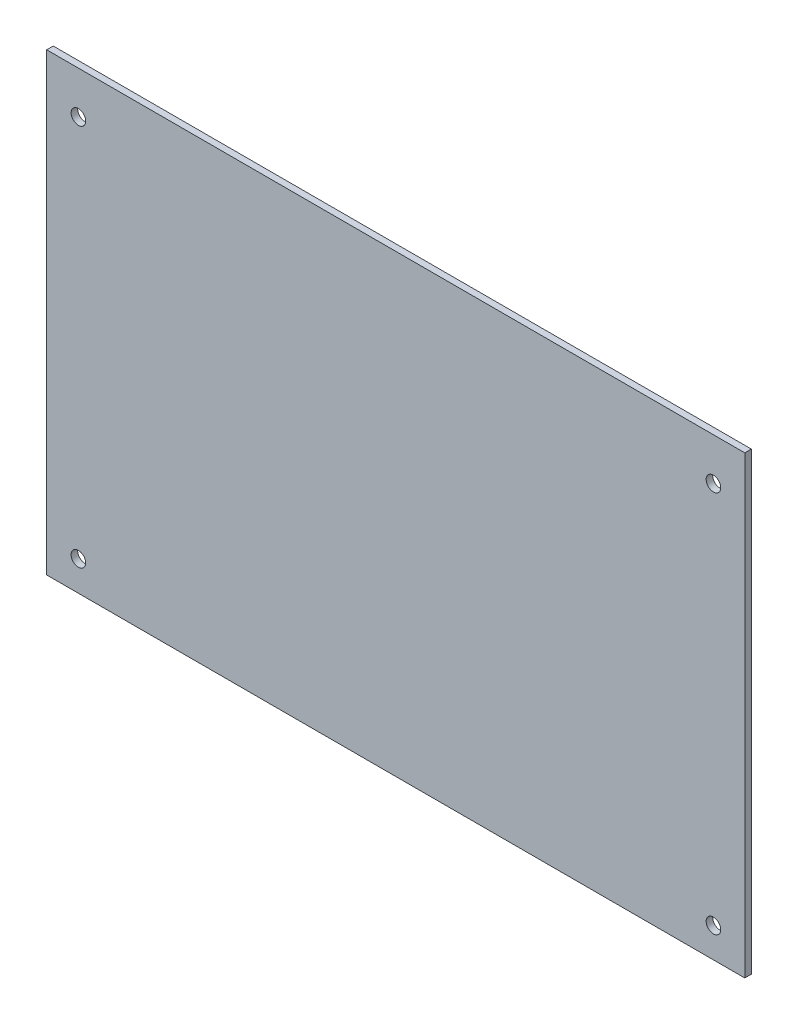
ISO-10303-21;
HEADER;
FILE_DESCRIPTION(('STEP AP214'),'2;1');
FILE_NAME('part.step','',(''),(''),'','','');
FILE_SCHEMA(('AUTOMOTIVE_DESIGN { 1 0 10303 214 1 1 1 1 }'));
ENDSEC;
DATA;
#1=APPLICATION_CONTEXT('core data for automotive mechanical design processes');
#2=APPLICATION_PROTOCOL_DEFINITION('international standard','automotive_design',2000,#1);
#3=PRODUCT_CONTEXT('',#1,'mechanical');
#4=PRODUCT('Part','Part','',(#3));
#5=PRODUCT_RELATED_PRODUCT_CATEGORY('part','',(#4));
#6=PRODUCT_DEFINITION_FORMATION('','',#4);
#7=PRODUCT_DEFINITION_CONTEXT('part definition',#1,'design');
#8=PRODUCT_DEFINITION('design','',#6,#7);
#9=PRODUCT_DEFINITION_SHAPE('','',#8);
#10=(LENGTH_UNIT() NAMED_UNIT(*) SI_UNIT(.MILLI.,.METRE.));
#11=(NAMED_UNIT(*) PLANE_ANGLE_UNIT() SI_UNIT($,.RADIAN.));
#12=(NAMED_UNIT(*) SI_UNIT($,.STERADIAN.) SOLID_ANGLE_UNIT());
#13=UNCERTAINTY_MEASURE_WITH_UNIT(LENGTH_MEASURE(1.E-05),#10,'distance_accuracy_value','');
#14=(GEOMETRIC_REPRESENTATION_CONTEXT(3) GLOBAL_UNCERTAINTY_ASSIGNED_CONTEXT((#13)) GLOBAL_UNIT_ASSIGNED_CONTEXT((#10,
#11,#12)) REPRESENTATION_CONTEXT('',''));
#15=CARTESIAN_POINT('',(0.,0.,0.));
#16=DIRECTION('',(0.,0.,1.));
#17=DIRECTION('',(1.,0.,0.));
#18=AXIS2_PLACEMENT_3D('',#15,#16,#17);
#19=CARTESIAN_POINT('',(-37.4746568246568,-37.6213286713287,0.));
#20=DIRECTION('',(0.,0.,1.));
#21=DIRECTION('',(1.,0.,0.));
#22=AXIS2_PLACEMENT_3D('',#19,#20,#21);
#23=PLANE('',#22);
#24=CARTESIAN_POINT('',(122.645343175343,-30.4613286713287,0.));
#25=DIRECTION('',(0.,0.,1.));
#26=DIRECTION('',(1.,0.,0.));
#27=AXIS2_PLACEMENT_3D('',#24,#25,#26);
#28=CIRCLE('',#27,1.75);
#29=CARTESIAN_POINT('',(124.395343175343,-30.4613286713287,0.));
#30=VERTEX_POINT('',#29);
#31=EDGE_CURVE('E39',#30,#30,#28,.T.);
#32=ORIENTED_EDGE('',*,*,#31,.T.);
#33=EDGE_LOOP('',(#32));
#34=FACE_BOUND('',#33,.T.);
#35=CARTESIAN_POINT('',(-29.8546568246568,-30.4613286713287,0.));
#36=DIRECTION('',(0.,0.,1.));
#37=DIRECTION('',(1.,0.,0.));
#38=AXIS2_PLACEMENT_3D('',#35,#36,#37);
#39=CIRCLE('',#38,1.75);
#40=CARTESIAN_POINT('',(-28.1046568246568,-30.4613286713287,0.));
#41=VERTEX_POINT('',#40);
#42=EDGE_CURVE('E166',#41,#41,#39,.T.);
#43=ORIENTED_EDGE('',*,*,#42,.T.);
#44=EDGE_LOOP('',(#43));
#45=FACE_BOUND('',#44,.T.);
#46=DIRECTION('',(0.,-1.,0.));
#47=VECTOR('',#46,1.);
#48=CARTESIAN_POINT('',(-37.4746568246568,71.5986713286713,0.));
#49=LINE('',#48,#47);
#50=CARTESIAN_POINT('',(-37.4746568246568,71.5986713286713,0.));
#51=VERTEX_POINT('',#50);
#52=CARTESIAN_POINT('',(-37.4746568246568,-37.6213286713287,0.));
#53=VERTEX_POINT('',#52);
#54=EDGE_CURVE('E136',#51,#53,#49,.T.);
#55=ORIENTED_EDGE('',*,*,#54,.F.);
#56=DIRECTION('',(-1.,0.,0.));
#57=VECTOR('',#56,1.);
#58=CARTESIAN_POINT('',(-37.4746568246568,71.5986713286713,0.));
#59=LINE('',#58,#57);
#60=CARTESIAN_POINT('',(130.165343175343,71.5986713286713,0.));
#61=VERTEX_POINT('',#60);
#62=EDGE_CURVE('E143',#61,#51,#59,.T.);
#63=ORIENTED_EDGE('',*,*,#62,.F.);
#64=DIRECTION('',(0.,1.,0.));
#65=VECTOR('',#64,1.);
#66=CARTESIAN_POINT('',(130.165343175343,71.5986713286713,0.));
#67=LINE('',#66,#65);
#68=CARTESIAN_POINT('',(130.165343175343,-37.6213286713287,0.));
#69=VERTEX_POINT('',#68);
#70=EDGE_CURVE('E141',#69,#61,#67,.T.);
#71=ORIENTED_EDGE('',*,*,#70,.F.);
#72=DIRECTION('',(1.,0.,0.));
#73=VECTOR('',#72,1.);
#74=CARTESIAN_POINT('',(-37.4746568246568,-37.6213286713287,0.));
#75=LINE('',#74,#73);
#76=EDGE_CURVE('E139',#53,#69,#75,.T.);
#77=ORIENTED_EDGE('',*,*,#76,.F.);
#78=EDGE_LOOP('',(#55,#63,#71,#77));
#79=FACE_BOUND('',#78,.T.);
#80=CARTESIAN_POINT('',(-29.8546568246568,61.4386713286713,0.));
#81=DIRECTION('',(0.,0.,1.));
#82=DIRECTION('',(1.,0.,0.));
#83=AXIS2_PLACEMENT_3D('',#80,#81,#82);
#84=CIRCLE('',#83,1.75);
#85=CARTESIAN_POINT('',(-28.1046568246568,61.4386713286713,0.));
#86=VERTEX_POINT('',#85);
#87=EDGE_CURVE('E133',#86,#86,#84,.T.);
#88=ORIENTED_EDGE('',*,*,#87,.T.);
#89=EDGE_LOOP('',(#88));
#90=FACE_BOUND('',#89,.T.);
#91=CARTESIAN_POINT('',(122.645343175343,61.4386713286713,0.));
#92=DIRECTION('',(0.,0.,1.));
#93=DIRECTION('',(1.,0.,0.));
#94=AXIS2_PLACEMENT_3D('',#91,#92,#93);
#95=CIRCLE('',#94,1.75);
#96=CARTESIAN_POINT('',(124.395343175343,61.4386713286713,0.));
#97=VERTEX_POINT('',#96);
#98=EDGE_CURVE('E124',#97,#97,#95,.T.);
#99=ORIENTED_EDGE('',*,*,#98,.T.);
#100=EDGE_LOOP('',(#99));
#101=FACE_BOUND('',#100,.T.);
#102=DIRECTION('',(0.,-1.,0.));
#103=VECTOR('',#102,1.);
#104=CARTESIAN_POINT('',(-3.62305188638526,1.0732055598722,0.));
#105=LINE('',#104,#103);
#106=CARTESIAN_POINT('',(-3.62305188638526,1.0732055598722,0.));
#107=VERTEX_POINT('',#106);
#108=CARTESIAN_POINT('',(-3.62305188638527,-5.05586290252958,0.));
#109=VERTEX_POINT('',#108);
#110=EDGE_CURVE('E92',#107,#109,#105,.T.);
#111=ORIENTED_EDGE('',*,*,#110,.F.);
#112=DIRECTION('',(1.,0.,0.));
#113=VECTOR('',#112,1.);
#114=CARTESIAN_POINT('',(-3.62305188638526,1.0732055598722,0.));
#115=LINE('',#114,#113);
#116=CARTESIAN_POINT('',(-11.0862617629284,1.07320555987218,0.));
#117=VERTEX_POINT('',#116);
#118=EDGE_CURVE('E94',#117,#107,#115,.T.);
#119=ORIENTED_EDGE('',*,*,#118,.F.);
#120=DIRECTION('',(0.,1.,0.));
#121=VECTOR('',#120,1.);
#122=CARTESIAN_POINT('',(-11.0862617629284,1.07320555987218,0.));
#123=LINE('',#122,#121);
#124=CARTESIAN_POINT('',(-11.0862617629284,-5.05586290252958,0.));
#125=VERTEX_POINT('',#124);
#126=EDGE_CURVE('E51',#125,#117,#123,.T.);
#127=ORIENTED_EDGE('',*,*,#126,.F.);
#128=DIRECTION('',(-1.,0.,0.));
#129=VECTOR('',#128,1.);
#130=CARTESIAN_POINT('',(-3.62305188638526,-5.05586290252958,0.));
#131=LINE('',#130,#129);
#132=EDGE_CURVE('E46',#109,#125,#131,.T.);
#133=ORIENTED_EDGE('',*,*,#132,.F.);
#134=EDGE_LOOP('',(#111,#119,#127,#133));
#135=FACE_BOUND('',#134,.T.);
#136=ADVANCED_FACE('F31',(#34,#45,#79,#90,#101,#135),#23,.F.);
#137=CARTESIAN_POINT('',(-37.4746568246568,71.5986713286713,1.5748));
#138=DIRECTION('',(1.,0.,0.));
#139=DIRECTION('',(0.,1.,0.));
#140=AXIS2_PLACEMENT_3D('',#137,#138,#139);
#141=PLANE('',#140);
#142=ORIENTED_EDGE('',*,*,#54,.T.);
#143=DIRECTION('',(0.,0.,-1.));
#144=VECTOR('',#143,1.);
#145=CARTESIAN_POINT('',(-37.4746568246568,-37.6213286713287,1.5748));
#146=LINE('',#145,#144);
#147=CARTESIAN_POINT('',(-37.4746568246568,-37.6213286713287,1.5748));
#148=VERTEX_POINT('',#147);
#149=EDGE_CURVE('E163',#148,#53,#146,.T.);
#150=ORIENTED_EDGE('',*,*,#149,.F.);
#151=DIRECTION('',(0.,-1.,0.));
#152=VECTOR('',#151,1.);
#153=CARTESIAN_POINT('',(-37.4746568246568,71.5986713286713,1.5748));
#154=LINE('',#153,#152);
#155=CARTESIAN_POINT('',(-37.4746568246568,71.5986713286713,1.5748));
#156=VERTEX_POINT('',#155);
#157=EDGE_CURVE('E145',#156,#148,#154,.T.);
#158=ORIENTED_EDGE('',*,*,#157,.F.);
#159=DIRECTION('',(0.,0.,-1.));
#160=VECTOR('',#159,1.);
#161=CARTESIAN_POINT('',(-37.4746568246568,71.5986713286713,1.5748));
#162=LINE('',#161,#160);
#163=EDGE_CURVE('E154',#156,#51,#162,.T.);
#164=ORIENTED_EDGE('',*,*,#163,.T.);
#165=EDGE_LOOP('',(#142,#150,#158,#164));
#166=FACE_BOUND('',#165,.T.);
#167=ADVANCED_FACE('F201',(#166),#141,.F.);
#168=CARTESIAN_POINT('',(-37.4746568246568,-37.6213286713287,1.5748));
#169=DIRECTION('',(0.,1.,0.));
#170=DIRECTION('',(0.,0.,1.));
#171=AXIS2_PLACEMENT_3D('',#168,#169,#170);
#172=PLANE('',#171);
#173=ORIENTED_EDGE('',*,*,#76,.T.);
#174=DIRECTION('',(0.,0.,-1.));
#175=VECTOR('',#174,1.);
#176=CARTESIAN_POINT('',(130.165343175343,-37.6213286713287,1.5748));
#177=LINE('',#176,#175);
#178=CARTESIAN_POINT('',(130.165343175343,-37.6213286713287,1.5748));
#179=VERTEX_POINT('',#178);
#180=EDGE_CURVE('E160',#179,#69,#177,.T.);
#181=ORIENTED_EDGE('',*,*,#180,.F.);
#182=DIRECTION('',(1.,0.,0.));
#183=VECTOR('',#182,1.);
#184=CARTESIAN_POINT('',(-37.4746568246568,-37.6213286713287,1.5748));
#185=LINE('',#184,#183);
#186=EDGE_CURVE('E148',#148,#179,#185,.T.);
#187=ORIENTED_EDGE('',*,*,#186,.F.);
#188=ORIENTED_EDGE('',*,*,#149,.T.);
#189=EDGE_LOOP('',(#173,#181,#187,#188));
#190=FACE_BOUND('',#189,.T.);
#191=ADVANCED_FACE('F205',(#190),#172,.F.);
#192=CARTESIAN_POINT('',(130.165343175343,71.5986713286713,1.5748));
#193=DIRECTION('',(-1.,0.,0.));
#194=DIRECTION('',(0.,-1.,0.));
#195=AXIS2_PLACEMENT_3D('',#192,#193,#194);
#196=PLANE('',#195);
#197=ORIENTED_EDGE('',*,*,#70,.T.);
#198=DIRECTION('',(0.,0.,-1.));
#199=VECTOR('',#198,1.);
#200=CARTESIAN_POINT('',(130.165343175343,71.5986713286713,1.5748));
#201=LINE('',#200,#199);
#202=CARTESIAN_POINT('',(130.165343175343,71.5986713286713,1.5748));
#203=VERTEX_POINT('',#202);
#204=EDGE_CURVE('E157',#203,#61,#201,.T.);
#205=ORIENTED_EDGE('',*,*,#204,.F.);
#206=DIRECTION('',(0.,1.,0.));
#207=VECTOR('',#206,1.);
#208=CARTESIAN_POINT('',(130.165343175343,71.5986713286713,1.5748));
#209=LINE('',#208,#207);
#210=EDGE_CURVE('E150',#179,#203,#209,.T.);
#211=ORIENTED_EDGE('',*,*,#210,.F.);
#212=ORIENTED_EDGE('',*,*,#180,.T.);
#213=EDGE_LOOP('',(#197,#205,#211,#212));
#214=FACE_BOUND('',#213,.T.);
#215=ADVANCED_FACE('F194',(#214),#196,.F.);
#216=CARTESIAN_POINT('',(-37.4746568246568,71.5986713286713,1.5748));
#217=DIRECTION('',(0.,-1.,0.));
#218=DIRECTION('',(0.,0.,-1.));
#219=AXIS2_PLACEMENT_3D('',#216,#217,#218);
#220=PLANE('',#219);
#221=ORIENTED_EDGE('',*,*,#62,.T.);
#222=ORIENTED_EDGE('',*,*,#163,.F.);
#223=DIRECTION('',(-1.,0.,0.));
#224=VECTOR('',#223,1.);
#225=CARTESIAN_POINT('',(-37.4746568246568,71.5986713286713,1.5748));
#226=LINE('',#225,#224);
#227=EDGE_CURVE('E152',#203,#156,#226,.T.);
#228=ORIENTED_EDGE('',*,*,#227,.F.);
#229=ORIENTED_EDGE('',*,*,#204,.T.);
#230=EDGE_LOOP('',(#221,#222,#228,#229));
#231=FACE_BOUND('',#230,.T.);
#232=ADVANCED_FACE('F184',(#231),#220,.F.);
#233=CARTESIAN_POINT('',(-37.4746568246568,-37.6213286713287,1.5748));
#234=DIRECTION('',(0.,0.,1.));
#235=DIRECTION('',(1.,0.,0.));
#236=AXIS2_PLACEMENT_3D('',#233,#234,#235);
#237=PLANE('',#236);
#238=CARTESIAN_POINT('',(122.645343175343,61.4386713286713,1.5748));
#239=DIRECTION('',(0.,0.,1.));
#240=DIRECTION('',(1.,0.,0.));
#241=AXIS2_PLACEMENT_3D('',#238,#239,#240);
#242=CIRCLE('',#241,1.75);
#243=CARTESIAN_POINT('',(124.395343175343,61.4386713286713,1.5748));
#244=VERTEX_POINT('',#243);
#245=EDGE_CURVE('E127',#244,#244,#242,.T.);
#246=ORIENTED_EDGE('',*,*,#245,.F.);
#247=EDGE_LOOP('',(#246));
#248=FACE_BOUND('',#247,.T.);
#249=CARTESIAN_POINT('',(-29.8546568246568,61.4386713286713,1.5748));
#250=DIRECTION('',(0.,0.,1.));
#251=DIRECTION('',(1.,0.,0.));
#252=AXIS2_PLACEMENT_3D('',#249,#250,#251);
#253=CIRCLE('',#252,1.75);
#254=CARTESIAN_POINT('',(-28.1046568246568,61.4386713286713,1.5748));
#255=VERTEX_POINT('',#254);
#256=EDGE_CURVE('E130',#255,#255,#253,.T.);
#257=ORIENTED_EDGE('',*,*,#256,.F.);
#258=EDGE_LOOP('',(#257));
#259=FACE_BOUND('',#258,.T.);
#260=ORIENTED_EDGE('',*,*,#157,.T.);
#261=ORIENTED_EDGE('',*,*,#186,.T.);
#262=ORIENTED_EDGE('',*,*,#210,.T.);
#263=ORIENTED_EDGE('',*,*,#227,.T.);
#264=EDGE_LOOP('',(#260,#261,#262,#263));
#265=FACE_BOUND('',#264,.T.);
#266=CARTESIAN_POINT('',(-29.8546568246568,-30.4613286713287,1.5748));
#267=DIRECTION('',(0.,0.,1.));
#268=DIRECTION('',(1.,0.,0.));
#269=AXIS2_PLACEMENT_3D('',#266,#267,#268);
#270=CIRCLE('',#269,1.75);
#271=CARTESIAN_POINT('',(-28.1046568246568,-30.4613286713287,1.5748));
#272=VERTEX_POINT('',#271);
#273=EDGE_CURVE('E169',#272,#272,#270,.T.);
#274=ORIENTED_EDGE('',*,*,#273,.F.);
#275=EDGE_LOOP('',(#274));
#276=FACE_BOUND('',#275,.T.);
#277=CARTESIAN_POINT('',(122.645343175343,-30.4613286713287,1.5748));
#278=DIRECTION('',(0.,0.,1.));
#279=DIRECTION('',(1.,0.,0.));
#280=AXIS2_PLACEMENT_3D('',#277,#278,#279);
#281=CIRCLE('',#280,1.75);
#282=CARTESIAN_POINT('',(124.395343175343,-30.4613286713287,1.5748));
#283=VERTEX_POINT('',#282);
#284=EDGE_CURVE('E11',#283,#283,#281,.T.);
#285=ORIENTED_EDGE('',*,*,#284,.F.);
#286=EDGE_LOOP('',(#285));
#287=FACE_BOUND('',#286,.T.);
#288=ADVANCED_FACE('F181',(#248,#259,#265,#276,#287),#237,.T.);
#289=CARTESIAN_POINT('',(-29.8546568246568,61.4386713286713,0.));
#290=DIRECTION('',(0.,0.,1.));
#291=DIRECTION('',(1.,0.,0.));
#292=AXIS2_PLACEMENT_3D('',#289,#290,#291);
#293=CYLINDRICAL_SURFACE('',#292,1.75);
#294=ORIENTED_EDGE('',*,*,#87,.F.);
#295=EDGE_LOOP('',(#294));
#296=FACE_BOUND('',#295,.T.);
#297=ORIENTED_EDGE('',*,*,#256,.T.);
#298=EDGE_LOOP('',(#297));
#299=FACE_BOUND('',#298,.T.);
#300=ADVANCED_FACE('F183',(#296,#299),#293,.F.);
#301=CARTESIAN_POINT('',(122.645343175343,61.4386713286713,0.));
#302=DIRECTION('',(0.,0.,1.));
#303=DIRECTION('',(1.,0.,0.));
#304=AXIS2_PLACEMENT_3D('',#301,#302,#303);
#305=CYLINDRICAL_SURFACE('',#304,1.75);
#306=ORIENTED_EDGE('',*,*,#98,.F.);
#307=EDGE_LOOP('',(#306));
#308=FACE_BOUND('',#307,.T.);
#309=ORIENTED_EDGE('',*,*,#245,.T.);
#310=EDGE_LOOP('',(#309));
#311=FACE_BOUND('',#310,.T.);
#312=ADVANCED_FACE('F191',(#308,#311),#305,.F.);
#313=CARTESIAN_POINT('',(-29.8546568246568,-30.4613286713287,0.));
#314=DIRECTION('',(0.,0.,1.));
#315=DIRECTION('',(1.,0.,0.));
#316=AXIS2_PLACEMENT_3D('',#313,#314,#315);
#317=CYLINDRICAL_SURFACE('',#316,1.75);
#318=ORIENTED_EDGE('',*,*,#42,.F.);
#319=EDGE_LOOP('',(#318));
#320=FACE_BOUND('',#319,.T.);
#321=ORIENTED_EDGE('',*,*,#273,.T.);
#322=EDGE_LOOP('',(#321));
#323=FACE_BOUND('',#322,.T.);
#324=ADVANCED_FACE('F178',(#320,#323),#317,.F.);
#325=CARTESIAN_POINT('',(122.645343175343,-30.4613286713287,0.));
#326=DIRECTION('',(0.,0.,1.));
#327=DIRECTION('',(1.,0.,0.));
#328=AXIS2_PLACEMENT_3D('',#325,#326,#327);
#329=CYLINDRICAL_SURFACE('',#328,1.75);
#330=ORIENTED_EDGE('',*,*,#31,.F.);
#331=EDGE_LOOP('',(#330));
#332=FACE_BOUND('',#331,.T.);
#333=ORIENTED_EDGE('',*,*,#284,.T.);
#334=EDGE_LOOP('',(#333));
#335=FACE_BOUND('',#334,.T.);
#336=ADVANCED_FACE('F33',(#332,#335),#329,.F.);
#337=CARTESIAN_POINT('',(-3.62305188638526,1.0732055598722,-3.75));
#338=DIRECTION('',(-1.,0.,0.));
#339=DIRECTION('',(0.,-1.,0.));
#340=AXIS2_PLACEMENT_3D('',#337,#338,#339);
#341=PLANE('',#340);
#342=ORIENTED_EDGE('',*,*,#110,.T.);
#343=DIRECTION('',(0.,0.,1.));
#344=VECTOR('',#343,1.);
#345=CARTESIAN_POINT('',(-3.62305188638526,-5.05586290252958,-3.75));
#346=LINE('',#345,#344);
#347=CARTESIAN_POINT('',(-3.62305188638526,-5.05586290252958,-3.75));
#348=VERTEX_POINT('',#347);
#349=EDGE_CURVE('E122',#348,#109,#346,.T.);
#350=ORIENTED_EDGE('',*,*,#349,.F.);
#351=DIRECTION('',(0.,-1.,0.));
#352=VECTOR('',#351,1.);
#353=CARTESIAN_POINT('',(-3.62305188638526,1.0732055598722,-3.75));
#354=LINE('',#353,#352);
#355=CARTESIAN_POINT('',(-3.62305188638526,1.0732055598722,-3.75));
#356=VERTEX_POINT('',#355);
#357=EDGE_CURVE('E108',#356,#348,#354,.T.);
#358=ORIENTED_EDGE('',*,*,#357,.F.);
#359=DIRECTION('',(0.,0.,1.));
#360=VECTOR('',#359,1.);
#361=CARTESIAN_POINT('',(-3.62305188638526,1.0732055598722,-3.75));
#362=LINE('',#361,#360);
#363=EDGE_CURVE('E104',#356,#107,#362,.T.);
#364=ORIENTED_EDGE('',*,*,#363,.T.);
#365=EDGE_LOOP('',(#342,#350,#358,#364));
#366=FACE_BOUND('',#365,.T.);
#367=ADVANCED_FACE('F110',(#366),#341,.F.);
#368=CARTESIAN_POINT('',(-3.62305188638526,-5.05586290252958,-3.75));
#369=DIRECTION('',(0.,1.,0.));
#370=DIRECTION('',(-1.,0.,0.));
#371=AXIS2_PLACEMENT_3D('',#368,#369,#370);
#372=PLANE('',#371);
#373=ORIENTED_EDGE('',*,*,#132,.T.);
#374=DIRECTION('',(0.,0.,1.));
#375=VECTOR('',#374,1.);
#376=CARTESIAN_POINT('',(-11.0862617629284,-5.05586290252958,-3.75));
#377=LINE('',#376,#375);
#378=CARTESIAN_POINT('',(-11.0862617629284,-5.05586290252958,-3.75));
#379=VERTEX_POINT('',#378);
#380=EDGE_CURVE('E114',#379,#125,#377,.T.);
#381=ORIENTED_EDGE('',*,*,#380,.F.);
#382=DIRECTION('',(-1.,0.,0.));
#383=VECTOR('',#382,1.);
#384=CARTESIAN_POINT('',(-3.62305188638526,-5.05586290252958,-3.75));
#385=LINE('',#384,#383);
#386=EDGE_CURVE('E229',#348,#379,#385,.T.);
#387=ORIENTED_EDGE('',*,*,#386,.F.);
#388=ORIENTED_EDGE('',*,*,#349,.T.);
#389=EDGE_LOOP('',(#373,#381,#387,#388));
#390=FACE_BOUND('',#389,.T.);
#391=ADVANCED_FACE('F214',(#390),#372,.F.);
#392=CARTESIAN_POINT('',(-11.0862617629284,1.07320555987218,-3.75));
#393=DIRECTION('',(1.,0.,0.));
#394=DIRECTION('',(0.,0.,-1.));
#395=AXIS2_PLACEMENT_3D('',#392,#393,#394);
#396=PLANE('',#395);
#397=ORIENTED_EDGE('',*,*,#126,.T.);
#398=DIRECTION('',(0.,0.,1.));
#399=VECTOR('',#398,1.);
#400=CARTESIAN_POINT('',(-11.0862617629284,1.07320555987218,-3.75));
#401=LINE('',#400,#399);
#402=CARTESIAN_POINT('',(-11.0862617629284,1.07320555987218,-3.75));
#403=VERTEX_POINT('',#402);
#404=EDGE_CURVE('E107',#403,#117,#401,.T.);
#405=ORIENTED_EDGE('',*,*,#404,.F.);
#406=DIRECTION('',(0.,1.,0.));
#407=VECTOR('',#406,1.);
#408=CARTESIAN_POINT('',(-11.0862617629284,1.07320555987218,-3.75));
#409=LINE('',#408,#407);
#410=EDGE_CURVE('E116',#379,#403,#409,.T.);
#411=ORIENTED_EDGE('',*,*,#410,.F.);
#412=ORIENTED_EDGE('',*,*,#380,.T.);
#413=EDGE_LOOP('',(#397,#405,#411,#412));
#414=FACE_BOUND('',#413,.T.);
#415=ADVANCED_FACE('F217',(#414),#396,.F.);
#416=CARTESIAN_POINT('',(-3.62305188638526,1.0732055598722,-3.75));
#417=DIRECTION('',(0.,-1.,0.));
#418=DIRECTION('',(1.,0.,0.));
#419=AXIS2_PLACEMENT_3D('',#416,#417,#418);
#420=PLANE('',#419);
#421=ORIENTED_EDGE('',*,*,#118,.T.);
#422=ORIENTED_EDGE('',*,*,#363,.F.);
#423=DIRECTION('',(1.,0.,0.));
#424=VECTOR('',#423,1.);
#425=CARTESIAN_POINT('',(-3.62305188638526,1.0732055598722,-3.75));
#426=LINE('',#425,#424);
#427=EDGE_CURVE('E112',#403,#356,#426,.T.);
#428=ORIENTED_EDGE('',*,*,#427,.F.);
#429=ORIENTED_EDGE('',*,*,#404,.T.);
#430=EDGE_LOOP('',(#421,#422,#428,#429));
#431=FACE_BOUND('',#430,.T.);
#432=ADVANCED_FACE('F102',(#431),#420,.F.);
#433=CARTESIAN_POINT('',(-3.62305188638526,-5.05586290252958,-3.75));
#434=DIRECTION('',(0.,0.,-1.));
#435=DIRECTION('',(-1.,0.,0.));
#436=AXIS2_PLACEMENT_3D('',#433,#434,#435);
#437=PLANE('',#436);
#438=ORIENTED_EDGE('',*,*,#357,.T.);
#439=ORIENTED_EDGE('',*,*,#386,.T.);
#440=ORIENTED_EDGE('',*,*,#410,.T.);
#441=ORIENTED_EDGE('',*,*,#427,.T.);
#442=EDGE_LOOP('',(#438,#439,#440,#441));
#443=FACE_BOUND('',#442,.T.);
#444=ADVANCED_FACE('F224',(#443),#437,.T.);
#445=CLOSED_SHELL('',(#136,#167,#191,#215,#232,#288,#300,#312,#324,#336,#367,#391,#415,#432,#444));
#446=MANIFOLD_SOLID_BREP('B2',#445);
#447=ADVANCED_BREP_SHAPE_REPRESENTATION('',(#18,#446),#14);
#448=SHAPE_DEFINITION_REPRESENTATION(#9,#447);
ENDSEC;
END-ISO-10303-21;
